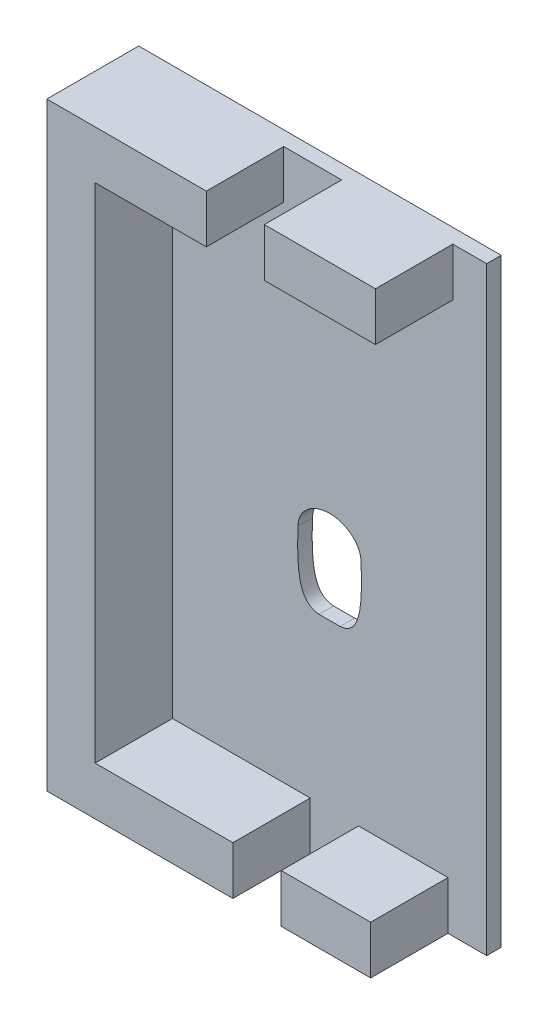
ISO-10303-21;
HEADER;
FILE_DESCRIPTION(('STEP AP214'),'2;1');
FILE_NAME('part.step','',(''),(''),'','','');
FILE_SCHEMA(('AUTOMOTIVE_DESIGN { 1 0 10303 214 1 1 1 1 }'));
ENDSEC;
DATA;
#1=APPLICATION_CONTEXT('core data for automotive mechanical design processes');
#2=APPLICATION_PROTOCOL_DEFINITION('international standard','automotive_design',2000,#1);
#3=PRODUCT_CONTEXT('',#1,'mechanical');
#4=PRODUCT('Part','Part','',(#3));
#5=PRODUCT_RELATED_PRODUCT_CATEGORY('part','',(#4));
#6=PRODUCT_DEFINITION_FORMATION('','',#4);
#7=PRODUCT_DEFINITION_CONTEXT('part definition',#1,'design');
#8=PRODUCT_DEFINITION('design','',#6,#7);
#9=PRODUCT_DEFINITION_SHAPE('','',#8);
#10=(LENGTH_UNIT() NAMED_UNIT(*) SI_UNIT(.MILLI.,.METRE.));
#11=(NAMED_UNIT(*) PLANE_ANGLE_UNIT() SI_UNIT($,.RADIAN.));
#12=(NAMED_UNIT(*) SI_UNIT($,.STERADIAN.) SOLID_ANGLE_UNIT());
#13=UNCERTAINTY_MEASURE_WITH_UNIT(LENGTH_MEASURE(1.E-05),#10,'distance_accuracy_value','');
#14=(GEOMETRIC_REPRESENTATION_CONTEXT(3) GLOBAL_UNCERTAINTY_ASSIGNED_CONTEXT((#13)) GLOBAL_UNIT_ASSIGNED_CONTEXT((#10,
#11,#12)) REPRESENTATION_CONTEXT('',''));
#15=CARTESIAN_POINT('',(0.,0.,0.));
#16=DIRECTION('',(0.,0.,1.));
#17=DIRECTION('',(1.,0.,0.));
#18=AXIS2_PLACEMENT_3D('',#15,#16,#17);
#19=CARTESIAN_POINT('',(0.,0.,19.));
#20=DIRECTION('',(0.,0.,1.));
#21=DIRECTION('',(1.,0.,0.));
#22=AXIS2_PLACEMENT_3D('',#19,#20,#21);
#23=PLANE('',#22);
#24=DIRECTION('',(-1.,0.,0.));
#25=VECTOR('',#24,1.);
#26=CARTESIAN_POINT('',(48.5,10.,19.));
#27=LINE('',#26,#25);
#28=CARTESIAN_POINT('',(67.,10.,19.));
#29=VERTEX_POINT('',#28);
#30=CARTESIAN_POINT('',(48.5,10.,19.));
#31=VERTEX_POINT('',#30);
#32=EDGE_CURVE('E212',#29,#31,#27,.T.);
#33=ORIENTED_EDGE('',*,*,#32,.T.);
#34=DIRECTION('',(0.,-1.,0.));
#35=VECTOR('',#34,1.);
#36=CARTESIAN_POINT('',(48.5,0.,19.));
#37=LINE('',#36,#35);
#38=CARTESIAN_POINT('',(48.5,0.,19.));
#39=VERTEX_POINT('',#38);
#40=EDGE_CURVE('E201',#31,#39,#37,.T.);
#41=ORIENTED_EDGE('',*,*,#40,.T.);
#42=DIRECTION('',(1.,0.,0.));
#43=VECTOR('',#42,1.);
#44=CARTESIAN_POINT('',(0.,0.,19.));
#45=LINE('',#44,#43);
#46=CARTESIAN_POINT('',(67.,0.,19.));
#47=VERTEX_POINT('',#46);
#48=EDGE_CURVE('E185',#39,#47,#45,.T.);
#49=ORIENTED_EDGE('',*,*,#48,.T.);
#50=DIRECTION('',(0.,1.,0.));
#51=VECTOR('',#50,1.);
#52=CARTESIAN_POINT('',(67.,0.,19.));
#53=LINE('',#52,#51);
#54=EDGE_CURVE('E199',#47,#29,#53,.T.);
#55=ORIENTED_EDGE('',*,*,#54,.T.);
#56=EDGE_LOOP('',(#33,#41,#49,#55));
#57=FACE_BOUND('',#56,.T.);
#58=ADVANCED_FACE('F33',(#57),#23,.T.);
#59=DIRECTION('',(1.,0.,0.));
#60=VECTOR('',#59,1.);
#61=CARTESIAN_POINT('',(0.,124.,19.));
#62=LINE('',#61,#60);
#63=CARTESIAN_POINT('',(45.,124.,19.));
#64=VERTEX_POINT('',#63);
#65=CARTESIAN_POINT('',(68.,124.,19.));
#66=VERTEX_POINT('',#65);
#67=EDGE_CURVE('E518',#64,#66,#62,.T.);
#68=ORIENTED_EDGE('',*,*,#67,.F.);
#69=DIRECTION('',(0.,-1.,0.));
#70=VECTOR('',#69,1.);
#71=CARTESIAN_POINT('',(45.,124.,19.));
#72=LINE('',#71,#70);
#73=CARTESIAN_POINT('',(45.,114.,19.));
#74=VERTEX_POINT('',#73);
#75=EDGE_CURVE('E250',#64,#74,#72,.T.);
#76=ORIENTED_EDGE('',*,*,#75,.T.);
#77=CARTESIAN_POINT('',(68.,114.,19.));
#78=DIRECTION('',(-1.,0.,0.));
#79=VECTOR('',#78,1.);
#80=LINE('',#77,#79);
#81=CARTESIAN_POINT('',(68.,114.,19.));
#82=VERTEX_POINT('',#81);
#83=EDGE_CURVE('E261',#82,#74,#80,.T.);
#84=ORIENTED_EDGE('',*,*,#83,.F.);
#85=DIRECTION('',(0.,1.,0.));
#86=VECTOR('',#85,1.);
#87=CARTESIAN_POINT('',(68.,124.,19.));
#88=LINE('',#87,#86);
#89=EDGE_CURVE('E208',#82,#66,#88,.T.);
#90=ORIENTED_EDGE('',*,*,#89,.T.);
#91=EDGE_LOOP('',(#68,#76,#84,#90));
#92=FACE_BOUND('',#91,.T.);
#93=ADVANCED_FACE('F279',(#92),#23,.T.);
#94=DIRECTION('',(-1.,0.,0.));
#95=VECTOR('',#94,1.);
#96=CARTESIAN_POINT('',(20.,10.,19.));
#97=LINE('',#96,#95);
#98=CARTESIAN_POINT('',(38.5,10.,19.));
#99=VERTEX_POINT('',#98);
#100=CARTESIAN_POINT('',(10.,10.,19.));
#101=VERTEX_POINT('',#100);
#102=EDGE_CURVE('E215',#99,#101,#97,.T.);
#103=ORIENTED_EDGE('',*,*,#102,.T.);
#104=DIRECTION('',(0.,1.,0.));
#105=VECTOR('',#104,1.);
#106=CARTESIAN_POINT('',(10.,124.,19.));
#107=LINE('',#106,#105);
#108=CARTESIAN_POINT('',(10.,114.,19.));
#109=VERTEX_POINT('',#108);
#110=EDGE_CURVE('E253',#101,#109,#107,.T.);
#111=ORIENTED_EDGE('',*,*,#110,.T.);
#112=CARTESIAN_POINT('',(33.,114.,19.));
#113=DIRECTION('',(-1.,0.,0.));
#114=VECTOR('',#113,1.);
#115=LINE('',#112,#114);
#116=CARTESIAN_POINT('',(33.,114.,19.));
#117=VERTEX_POINT('',#116);
#118=EDGE_CURVE('E520',#117,#109,#115,.T.);
#119=ORIENTED_EDGE('',*,*,#118,.F.);
#120=DIRECTION('',(0.,1.,0.));
#121=VECTOR('',#120,1.);
#122=CARTESIAN_POINT('',(33.,124.,19.));
#123=LINE('',#122,#121);
#124=CARTESIAN_POINT('',(33.,124.,19.));
#125=VERTEX_POINT('',#124);
#126=EDGE_CURVE('E203',#117,#125,#123,.T.);
#127=ORIENTED_EDGE('',*,*,#126,.T.);
#128=CARTESIAN_POINT('',(0.,124.,19.));
#129=VERTEX_POINT('',#128);
#130=EDGE_CURVE('E516',#129,#125,#62,.T.);
#131=ORIENTED_EDGE('',*,*,#130,.F.);
#132=DIRECTION('',(0.,1.,0.));
#133=VECTOR('',#132,1.);
#134=CARTESIAN_POINT('',(0.,0.,19.));
#135=LINE('',#134,#133);
#136=CARTESIAN_POINT('',(0.,0.,19.));
#137=VERTEX_POINT('',#136);
#138=EDGE_CURVE('E256',#137,#129,#135,.T.);
#139=ORIENTED_EDGE('',*,*,#138,.F.);
#140=CARTESIAN_POINT('',(38.5,0.,19.));
#141=VERTEX_POINT('',#140);
#142=EDGE_CURVE('E202',#137,#141,#45,.T.);
#143=ORIENTED_EDGE('',*,*,#142,.T.);
#144=DIRECTION('',(0.,1.,0.));
#145=VECTOR('',#144,1.);
#146=CARTESIAN_POINT('',(38.5,0.,19.));
#147=LINE('',#146,#145);
#148=EDGE_CURVE('E214',#141,#99,#147,.T.);
#149=ORIENTED_EDGE('',*,*,#148,.T.);
#150=EDGE_LOOP('',(#103,#111,#119,#127,#131,#139,#143,#149));
#151=FACE_BOUND('',#150,.T.);
#152=ADVANCED_FACE('F280',(#151),#23,.T.);
#153=CARTESIAN_POINT('',(40.3205360374278,43.8282784351919,45.001));
#154=CARTESIAN_POINT('',(36.940368492597,44.1088043462592,45.001));
#155=CARTESIAN_POINT('',(35.4948835545112,47.2516643831489,45.001));
#156=CARTESIAN_POINT('',(35.9840812231567,57.5,45.001));
#157=B_SPLINE_CURVE_WITH_KNOTS('',3,(#153,#154,#155,#156),.UNSPECIFIED.,.F.,.F.,(4,4),
(0.162125932616789,1.),.UNSPECIFIED.);
#158=DIRECTION('',(0.,0.,-1.));
#159=VECTOR('',#158,1.);
#160=SURFACE_OF_LINEAR_EXTRUSION('',#157,#159);
#161=CARTESIAN_POINT('',(40.3205360374278,43.8282784351919,3.));
#162=CARTESIAN_POINT('',(36.940368492597,44.1088043462592,3.));
#163=CARTESIAN_POINT('',(35.4948835545112,47.2516643831489,3.));
#164=CARTESIAN_POINT('',(35.9840812231567,57.5,3.));
#165=B_SPLINE_CURVE_WITH_KNOTS('',3,(#161,#162,#163,#164),.UNSPECIFIED.,.F.,.F.,(4,4),
(0.162125932616789,1.),.UNSPECIFIED.);
#166=CARTESIAN_POINT('',(35.9840812231567,57.5,3.));
#167=VERTEX_POINT('',#166);
#168=CARTESIAN_POINT('',(40.3205360374278,43.8282784351919,3.));
#169=VERTEX_POINT('',#168);
#170=EDGE_CURVE('E232',#167,#169,#165,.F.);
#171=ORIENTED_EDGE('',*,*,#170,.T.);
#172=DIRECTION('',(0.,0.,-1.));
#173=VECTOR('',#172,1.);
#174=CARTESIAN_POINT('',(40.3205360374278,43.8282784351919,45.001));
#175=LINE('',#174,#173);
#176=CARTESIAN_POINT('',(40.3205360374278,43.8282784351919,0.));
#177=VERTEX_POINT('',#176);
#178=EDGE_CURVE('E341',#169,#177,#175,.T.);
#179=ORIENTED_EDGE('',*,*,#178,.T.);
#180=CARTESIAN_POINT('',(40.3205360374278,43.8282784351919,0.));
#181=CARTESIAN_POINT('',(36.940368492597,44.1088043462592,0.));
#182=CARTESIAN_POINT('',(35.4948835545112,47.2516643831489,0.));
#183=CARTESIAN_POINT('',(35.9840812231567,57.5,0.));
#184=B_SPLINE_CURVE_WITH_KNOTS('',3,(#180,#181,#182,#183),.UNSPECIFIED.,.F.,.F.,(4,4),
(0.162125932616789,1.),.UNSPECIFIED.);
#185=CARTESIAN_POINT('',(35.9840812231567,57.5,0.));
#186=VERTEX_POINT('',#185);
#187=EDGE_CURVE('E539',#177,#186,#184,.T.);
#188=ORIENTED_EDGE('',*,*,#187,.T.);
#189=DIRECTION('',(0.,0.,-1.));
#190=VECTOR('',#189,1.);
#191=CARTESIAN_POINT('',(35.9840812231567,57.5,45.001));
#192=LINE('',#191,#190);
#193=EDGE_CURVE('E346',#167,#186,#192,.T.);
#194=ORIENTED_EDGE('',*,*,#193,.F.);
#195=EDGE_LOOP('',(#171,#179,#188,#194));
#196=FACE_BOUND('',#195,.T.);
#197=ADVANCED_FACE('F318',(#196),#160,.F.);
#198=CARTESIAN_POINT('',(44.6794639625724,43.8282784351919,45.001));
#199=DIRECTION('',(0.,-1.,0.));
#200=DIRECTION('',(0.,0.,-1.));
#201=AXIS2_PLACEMENT_3D('',#198,#199,#200);
#202=PLANE('',#201);
#203=DIRECTION('',(1.,0.,0.));
#204=VECTOR('',#203,1.);
#205=CARTESIAN_POINT('',(44.6794639625724,43.8282784351919,3.));
#206=LINE('',#205,#204);
#207=CARTESIAN_POINT('',(44.6794639625724,43.8282784351919,3.));
#208=VERTEX_POINT('',#207);
#209=EDGE_CURVE('E361',#169,#208,#206,.T.);
#210=ORIENTED_EDGE('',*,*,#209,.T.);
#211=DIRECTION('',(0.,0.,-1.));
#212=VECTOR('',#211,1.);
#213=CARTESIAN_POINT('',(44.6794639625724,43.8282784351919,45.001));
#214=LINE('',#213,#212);
#215=CARTESIAN_POINT('',(44.6794639625724,43.8282784351919,0.));
#216=VERTEX_POINT('',#215);
#217=EDGE_CURVE('E11',#208,#216,#214,.T.);
#218=ORIENTED_EDGE('',*,*,#217,.T.);
#219=DIRECTION('',(-1.,0.,0.));
#220=VECTOR('',#219,1.);
#221=CARTESIAN_POINT('',(44.6794639625724,43.8282784351919,0.));
#222=LINE('',#221,#220);
#223=EDGE_CURVE('E543',#216,#177,#222,.T.);
#224=ORIENTED_EDGE('',*,*,#223,.T.);
#225=ORIENTED_EDGE('',*,*,#178,.F.);
#226=EDGE_LOOP('',(#210,#218,#224,#225));
#227=FACE_BOUND('',#226,.T.);
#228=ADVANCED_FACE('F320',(#227),#202,.F.);
#229=CARTESIAN_POINT('',(49.0159187768433,57.5,45.001));
#230=CARTESIAN_POINT('',(49.5051164454888,47.2516643831521,45.001));
#231=CARTESIAN_POINT('',(48.0596315074031,44.1088043462593,45.001));
#232=CARTESIAN_POINT('',(44.6794639625725,43.8282784351919,45.001));
#233=B_SPLINE_CURVE_WITH_KNOTS('',3,(#229,#230,#231,#232),.UNSPECIFIED.,.F.,.F.,(4,4),
(0.162125932616804,1.),.UNSPECIFIED.);
#234=DIRECTION('',(0.,0.,-1.));
#235=VECTOR('',#234,1.);
#236=SURFACE_OF_LINEAR_EXTRUSION('',#233,#235);
#237=CARTESIAN_POINT('',(49.0159187768433,57.5,3.));
#238=CARTESIAN_POINT('',(49.5051164454888,47.2516643831521,3.));
#239=CARTESIAN_POINT('',(48.0596315074031,44.1088043462593,3.));
#240=CARTESIAN_POINT('',(44.6794639625725,43.8282784351919,3.));
#241=B_SPLINE_CURVE_WITH_KNOTS('',3,(#237,#238,#239,#240),.UNSPECIFIED.,.F.,.F.,(4,4),
(0.162125932616804,1.),.UNSPECIFIED.);
#242=CARTESIAN_POINT('',(49.0159187768433,57.5,3.));
#243=VERTEX_POINT('',#242);
#244=EDGE_CURVE('E357',#208,#243,#241,.F.);
#245=ORIENTED_EDGE('',*,*,#244,.T.);
#246=DIRECTION('',(0.,0.,-1.));
#247=VECTOR('',#246,1.);
#248=CARTESIAN_POINT('',(49.0159187768433,57.5,45.001));
#249=LINE('',#248,#247);
#250=CARTESIAN_POINT('',(49.0159187768433,57.5,0.));
#251=VERTEX_POINT('',#250);
#252=EDGE_CURVE('E42',#243,#251,#249,.T.);
#253=ORIENTED_EDGE('',*,*,#252,.T.);
#254=CARTESIAN_POINT('',(49.0159187768433,57.5,0.));
#255=CARTESIAN_POINT('',(49.5051164454888,47.2516643831521,0.));
#256=CARTESIAN_POINT('',(48.0596315074031,44.1088043462593,0.));
#257=CARTESIAN_POINT('',(44.6794639625725,43.8282784351919,0.));
#258=B_SPLINE_CURVE_WITH_KNOTS('',3,(#254,#255,#256,#257),.UNSPECIFIED.,.F.,.F.,(4,4),
(0.162125932616804,1.),.UNSPECIFIED.);
#259=EDGE_CURVE('E347',#251,#216,#258,.T.);
#260=ORIENTED_EDGE('',*,*,#259,.T.);
#261=ORIENTED_EDGE('',*,*,#217,.F.);
#262=EDGE_LOOP('',(#245,#253,#260,#261));
#263=FACE_BOUND('',#262,.T.);
#264=ADVANCED_FACE('F327',(#263),#236,.F.);
#265=CARTESIAN_POINT('',(42.5,57.5,45.001));
#266=DIRECTION('',(0.,0.,-1.));
#267=DIRECTION('',(-1.,0.,0.));
#268=AXIS2_PLACEMENT_3D('',#265,#266,#267);
#269=ELLIPSE('',#268,6.51591877684335,5.50395470143701);
#270=DIRECTION('',(0.,0.,-1.));
#271=VECTOR('',#270,1.);
#272=SURFACE_OF_LINEAR_EXTRUSION('',#269,#271);
#273=CARTESIAN_POINT('',(42.5,57.5,3.));
#274=DIRECTION('',(0.,0.,-1.));
#275=DIRECTION('',(-1.,0.,0.));
#276=AXIS2_PLACEMENT_3D('',#273,#274,#275);
#277=ELLIPSE('',#276,6.51591877684335,5.50395470143701);
#278=EDGE_CURVE('E352',#243,#167,#277,.F.);
#279=ORIENTED_EDGE('',*,*,#278,.T.);
#280=ORIENTED_EDGE('',*,*,#193,.T.);
#281=CARTESIAN_POINT('',(42.5,57.5,0.));
#282=DIRECTION('',(0.,0.,-1.));
#283=DIRECTION('',(-1.,0.,0.));
#284=AXIS2_PLACEMENT_3D('',#281,#282,#283);
#285=ELLIPSE('',#284,6.51591877684335,5.50395470143701);
#286=EDGE_CURVE('E535',#186,#251,#285,.T.);
#287=ORIENTED_EDGE('',*,*,#286,.T.);
#288=ORIENTED_EDGE('',*,*,#252,.F.);
#289=EDGE_LOOP('',(#279,#280,#287,#288));
#290=FACE_BOUND('',#289,.T.);
#291=ADVANCED_FACE('F287',(#290),#272,.F.);
#292=CARTESIAN_POINT('',(38.5,0.,45.));
#293=DIRECTION('',(-1.,0.,0.));
#294=DIRECTION('',(0.,0.,1.));
#295=AXIS2_PLACEMENT_3D('',#292,#293,#294);
#296=PLANE('',#295);
#297=ORIENTED_EDGE('',*,*,#148,.F.);
#298=DIRECTION('',(0.,0.,-1.));
#299=VECTOR('',#298,1.);
#300=CARTESIAN_POINT('',(38.5,0.,45.));
#301=LINE('',#300,#299);
#302=CARTESIAN_POINT('',(38.5,0.,3.));
#303=VERTEX_POINT('',#302);
#304=EDGE_CURVE('E500',#141,#303,#301,.T.);
#305=ORIENTED_EDGE('',*,*,#304,.T.);
#306=DIRECTION('',(0.,1.,0.));
#307=VECTOR('',#306,1.);
#308=CARTESIAN_POINT('',(38.5,0.,3.));
#309=LINE('',#308,#307);
#310=CARTESIAN_POINT('',(38.5,10.,3.));
#311=VERTEX_POINT('',#310);
#312=EDGE_CURVE('E396',#303,#311,#309,.T.);
#313=ORIENTED_EDGE('',*,*,#312,.T.);
#314=DIRECTION('',(0.,0.,-1.));
#315=VECTOR('',#314,1.);
#316=CARTESIAN_POINT('',(38.5,10.,45.));
#317=LINE('',#316,#315);
#318=EDGE_CURVE('E225',#99,#311,#317,.T.);
#319=ORIENTED_EDGE('',*,*,#318,.F.);
#320=EDGE_LOOP('',(#297,#305,#313,#319));
#321=FACE_BOUND('',#320,.T.);
#322=ADVANCED_FACE('F282',(#321),#296,.F.);
#323=CARTESIAN_POINT('',(0.,0.,0.));
#324=DIRECTION('',(0.,0.,-1.));
#325=DIRECTION('',(-1.,0.,0.));
#326=AXIS2_PLACEMENT_3D('',#323,#324,#325);
#327=PLANE('',#326);
#328=ORIENTED_EDGE('',*,*,#259,.F.);
#329=ORIENTED_EDGE('',*,*,#286,.F.);
#330=ORIENTED_EDGE('',*,*,#187,.F.);
#331=ORIENTED_EDGE('',*,*,#223,.F.);
#332=EDGE_LOOP('',(#328,#329,#330,#331));
#333=FACE_BOUND('',#332,.T.);
#334=DIRECTION('',(0.,1.,0.));
#335=VECTOR('',#334,1.);
#336=CARTESIAN_POINT('',(0.,0.,0.));
#337=LINE('',#336,#335);
#338=CARTESIAN_POINT('',(0.,0.,0.));
#339=VERTEX_POINT('',#338);
#340=CARTESIAN_POINT('',(0.,124.,0.));
#341=VERTEX_POINT('',#340);
#342=EDGE_CURVE('E420',#339,#341,#337,.T.);
#343=ORIENTED_EDGE('',*,*,#342,.T.);
#344=DIRECTION('',(1.,0.,0.));
#345=VECTOR('',#344,1.);
#346=CARTESIAN_POINT('',(0.,124.,0.));
#347=LINE('',#346,#345);
#348=CARTESIAN_POINT('',(75.,124.,0.));
#349=VERTEX_POINT('',#348);
#350=EDGE_CURVE('E470',#341,#349,#347,.T.);
#351=ORIENTED_EDGE('',*,*,#350,.T.);
#352=DIRECTION('',(0.,1.,0.));
#353=VECTOR('',#352,1.);
#354=CARTESIAN_POINT('',(75.,0.,0.));
#355=LINE('',#354,#353);
#356=CARTESIAN_POINT('',(75.,0.,0.));
#357=VERTEX_POINT('',#356);
#358=EDGE_CURVE('E464',#357,#349,#355,.T.);
#359=ORIENTED_EDGE('',*,*,#358,.F.);
#360=DIRECTION('',(1.,0.,0.));
#361=VECTOR('',#360,1.);
#362=CARTESIAN_POINT('',(0.,0.,0.));
#363=LINE('',#362,#361);
#364=EDGE_CURVE('E426',#339,#357,#363,.T.);
#365=ORIENTED_EDGE('',*,*,#364,.F.);
#366=EDGE_LOOP('',(#343,#351,#359,#365));
#367=FACE_BOUND('',#366,.T.);
#368=ADVANCED_FACE('F286',(#333,#367),#327,.T.);
#369=CARTESIAN_POINT('',(75.,0.,3.));
#370=DIRECTION('',(-1.,0.,0.));
#371=DIRECTION('',(0.,-1.,0.));
#372=AXIS2_PLACEMENT_3D('',#369,#370,#371);
#373=PLANE('',#372);
#374=ORIENTED_EDGE('',*,*,#358,.T.);
#375=DIRECTION('',(0.,0.,-1.));
#376=VECTOR('',#375,1.);
#377=CARTESIAN_POINT('',(75.,124.,3.));
#378=LINE('',#377,#376);
#379=CARTESIAN_POINT('',(75.,124.,3.));
#380=VERTEX_POINT('',#379);
#381=EDGE_CURVE('E416',#380,#349,#378,.T.);
#382=ORIENTED_EDGE('',*,*,#381,.F.);
#383=DIRECTION('',(0.,1.,0.));
#384=VECTOR('',#383,1.);
#385=CARTESIAN_POINT('',(75.,0.,3.));
#386=LINE('',#385,#384);
#387=CARTESIAN_POINT('',(75.,0.,3.));
#388=VERTEX_POINT('',#387);
#389=EDGE_CURVE('E415',#388,#380,#386,.T.);
#390=ORIENTED_EDGE('',*,*,#389,.F.);
#391=DIRECTION('',(0.,0.,-1.));
#392=VECTOR('',#391,1.);
#393=CARTESIAN_POINT('',(75.,0.,3.));
#394=LINE('',#393,#392);
#395=EDGE_CURVE('E467',#388,#357,#394,.T.);
#396=ORIENTED_EDGE('',*,*,#395,.T.);
#397=EDGE_LOOP('',(#374,#382,#390,#396));
#398=FACE_BOUND('',#397,.T.);
#399=ADVANCED_FACE('F293',(#398),#373,.F.);
#400=CARTESIAN_POINT('',(0.,0.,3.));
#401=DIRECTION('',(-1.,0.,0.));
#402=DIRECTION('',(0.,-1.,0.));
#403=AXIS2_PLACEMENT_3D('',#400,#401,#402);
#404=PLANE('',#403);
#405=DIRECTION('',(0.,0.,-1.));
#406=VECTOR('',#405,1.);
#407=CARTESIAN_POINT('',(0.,0.,3.));
#408=LINE('',#407,#406);
#409=EDGE_CURVE('E479',#137,#339,#408,.T.);
#410=ORIENTED_EDGE('',*,*,#409,.F.);
#411=ORIENTED_EDGE('',*,*,#138,.T.);
#412=DIRECTION('',(0.,0.,-1.));
#413=VECTOR('',#412,1.);
#414=CARTESIAN_POINT('',(0.,124.,3.));
#415=LINE('',#414,#413);
#416=EDGE_CURVE('E413',#129,#341,#415,.T.);
#417=ORIENTED_EDGE('',*,*,#416,.T.);
#418=ORIENTED_EDGE('',*,*,#342,.F.);
#419=EDGE_LOOP('',(#410,#411,#417,#418));
#420=FACE_BOUND('',#419,.T.);
#421=ADVANCED_FACE('F289',(#420),#404,.T.);
#422=CARTESIAN_POINT('',(0.,124.,3.));
#423=DIRECTION('',(0.,1.,0.));
#424=DIRECTION('',(0.,0.,1.));
#425=AXIS2_PLACEMENT_3D('',#422,#423,#424);
#426=PLANE('',#425);
#427=ORIENTED_EDGE('',*,*,#416,.F.);
#428=ORIENTED_EDGE('',*,*,#130,.T.);
#429=DIRECTION('',(0.,0.,-1.));
#430=VECTOR('',#429,1.);
#431=CARTESIAN_POINT('',(33.,124.,32.));
#432=LINE('',#431,#430);
#433=CARTESIAN_POINT('',(33.,124.,3.));
#434=VERTEX_POINT('',#433);
#435=EDGE_CURVE('E506',#125,#434,#432,.T.);
#436=ORIENTED_EDGE('',*,*,#435,.T.);
#437=DIRECTION('',(1.,0.,0.));
#438=VECTOR('',#437,1.);
#439=CARTESIAN_POINT('',(0.,124.,3.));
#440=LINE('',#439,#438);
#441=CARTESIAN_POINT('',(45.,124.,3.));
#442=VERTEX_POINT('',#441);
#443=EDGE_CURVE('E423',#434,#442,#440,.T.);
#444=ORIENTED_EDGE('',*,*,#443,.T.);
#445=DIRECTION('',(0.,0.,-1.));
#446=VECTOR('',#445,1.);
#447=CARTESIAN_POINT('',(45.,124.,32.));
#448=LINE('',#447,#446);
#449=EDGE_CURVE('E266',#64,#442,#448,.T.);
#450=ORIENTED_EDGE('',*,*,#449,.F.);
#451=ORIENTED_EDGE('',*,*,#67,.T.);
#452=DIRECTION('',(0.,0.,-1.));
#453=VECTOR('',#452,1.);
#454=CARTESIAN_POINT('',(68.,124.,32.));
#455=LINE('',#454,#453);
#456=CARTESIAN_POINT('',(68.,124.,3.));
#457=VERTEX_POINT('',#456);
#458=EDGE_CURVE('E532',#66,#457,#455,.T.);
#459=ORIENTED_EDGE('',*,*,#458,.T.);
#460=EDGE_CURVE('E424',#457,#380,#440,.T.);
#461=ORIENTED_EDGE('',*,*,#460,.T.);
#462=ORIENTED_EDGE('',*,*,#381,.T.);
#463=ORIENTED_EDGE('',*,*,#350,.F.);
#464=EDGE_LOOP('',(#427,#428,#436,#444,#450,#451,#459,#461,#462,#463));
#465=FACE_BOUND('',#464,.T.);
#466=ADVANCED_FACE('F292',(#465),#426,.T.);
#467=CARTESIAN_POINT('',(48.5,10.,45.));
#468=DIRECTION('',(0.,-1.,0.));
#469=DIRECTION('',(0.,0.,-1.));
#470=AXIS2_PLACEMENT_3D('',#467,#468,#469);
#471=PLANE('',#470);
#472=ORIENTED_EDGE('',*,*,#32,.F.);
#473=DIRECTION('',(0.,0.,-1.));
#474=VECTOR('',#473,1.);
#475=CARTESIAN_POINT('',(67.,10.,45.));
#476=LINE('',#475,#474);
#477=CARTESIAN_POINT('',(67.,10.,3.));
#478=VERTEX_POINT('',#477);
#479=EDGE_CURVE('E193',#29,#478,#476,.T.);
#480=ORIENTED_EDGE('',*,*,#479,.T.);
#481=DIRECTION('',(-1.,0.,0.));
#482=VECTOR('',#481,1.);
#483=CARTESIAN_POINT('',(48.5,10.,3.));
#484=LINE('',#483,#482);
#485=CARTESIAN_POINT('',(48.5,10.,3.));
#486=VERTEX_POINT('',#485);
#487=EDGE_CURVE('E224',#478,#486,#484,.T.);
#488=ORIENTED_EDGE('',*,*,#487,.T.);
#489=DIRECTION('',(0.,0.,-1.));
#490=VECTOR('',#489,1.);
#491=CARTESIAN_POINT('',(48.5,10.,45.));
#492=LINE('',#491,#490);
#493=EDGE_CURVE('E221',#31,#486,#492,.T.);
#494=ORIENTED_EDGE('',*,*,#493,.F.);
#495=EDGE_LOOP('',(#472,#480,#488,#494));
#496=FACE_BOUND('',#495,.T.);
#497=ADVANCED_FACE('F297',(#496),#471,.F.);
#498=CARTESIAN_POINT('',(0.,0.,3.));
#499=DIRECTION('',(0.,0.,-1.));
#500=DIRECTION('',(-1.,0.,0.));
#501=AXIS2_PLACEMENT_3D('',#498,#499,#500);
#502=PLANE('',#501);
#503=ORIENTED_EDGE('',*,*,#278,.F.);
#504=ORIENTED_EDGE('',*,*,#244,.F.);
#505=ORIENTED_EDGE('',*,*,#209,.F.);
#506=ORIENTED_EDGE('',*,*,#170,.F.);
#507=EDGE_LOOP('',(#503,#504,#505,#506));
#508=FACE_BOUND('',#507,.T.);
#509=DIRECTION('',(0.,1.,0.));
#510=VECTOR('',#509,1.);
#511=CARTESIAN_POINT('',(10.,124.,3.));
#512=LINE('',#511,#510);
#513=CARTESIAN_POINT('',(10.,9.99999999999999,3.));
#514=VERTEX_POINT('',#513);
#515=CARTESIAN_POINT('',(10.,114.,3.));
#516=VERTEX_POINT('',#515);
#517=EDGE_CURVE('E498',#514,#516,#512,.T.);
#518=ORIENTED_EDGE('',*,*,#517,.F.);
#519=DIRECTION('',(-1.,0.,0.));
#520=VECTOR('',#519,1.);
#521=CARTESIAN_POINT('',(20.,10.,3.));
#522=LINE('',#521,#520);
#523=EDGE_CURVE('E398',#311,#514,#522,.T.);
#524=ORIENTED_EDGE('',*,*,#523,.F.);
#525=ORIENTED_EDGE('',*,*,#312,.F.);
#526=DIRECTION('',(1.,0.,0.));
#527=VECTOR('',#526,1.);
#528=CARTESIAN_POINT('',(0.,0.,3.));
#529=LINE('',#528,#527);
#530=CARTESIAN_POINT('',(48.5,0.,3.));
#531=VERTEX_POINT('',#530);
#532=EDGE_CURVE('E411',#303,#531,#529,.T.);
#533=ORIENTED_EDGE('',*,*,#532,.T.);
#534=DIRECTION('',(0.,-1.,0.));
#535=VECTOR('',#534,1.);
#536=CARTESIAN_POINT('',(48.5,0.,3.));
#537=LINE('',#536,#535);
#538=EDGE_CURVE('E233',#486,#531,#537,.T.);
#539=ORIENTED_EDGE('',*,*,#538,.F.);
#540=ORIENTED_EDGE('',*,*,#487,.F.);
#541=DIRECTION('',(0.,1.,0.));
#542=VECTOR('',#541,1.);
#543=CARTESIAN_POINT('',(67.,0.,3.));
#544=LINE('',#543,#542);
#545=CARTESIAN_POINT('',(67.,0.,3.));
#546=VERTEX_POINT('',#545);
#547=EDGE_CURVE('E406',#546,#478,#544,.T.);
#548=ORIENTED_EDGE('',*,*,#547,.F.);
#549=EDGE_CURVE('E188',#546,#388,#529,.T.);
#550=ORIENTED_EDGE('',*,*,#549,.T.);
#551=ORIENTED_EDGE('',*,*,#389,.T.);
#552=ORIENTED_EDGE('',*,*,#460,.F.);
#553=DIRECTION('',(0.,1.,0.));
#554=VECTOR('',#553,1.);
#555=CARTESIAN_POINT('',(68.,124.,3.));
#556=LINE('',#555,#554);
#557=CARTESIAN_POINT('',(68.,114.,3.));
#558=VERTEX_POINT('',#557);
#559=EDGE_CURVE('E490',#558,#457,#556,.T.);
#560=ORIENTED_EDGE('',*,*,#559,.F.);
#561=DIRECTION('',(1.,0.,0.));
#562=VECTOR('',#561,1.);
#563=CARTESIAN_POINT('',(45.,114.,3.));
#564=LINE('',#563,#562);
#565=CARTESIAN_POINT('',(45.,114.,3.));
#566=VERTEX_POINT('',#565);
#567=EDGE_CURVE('E493',#566,#558,#564,.T.);
#568=ORIENTED_EDGE('',*,*,#567,.F.);
#569=DIRECTION('',(0.,-1.,0.));
#570=VECTOR('',#569,1.);
#571=CARTESIAN_POINT('',(45.,124.,3.));
#572=LINE('',#571,#570);
#573=EDGE_CURVE('E496',#442,#566,#572,.T.);
#574=ORIENTED_EDGE('',*,*,#573,.F.);
#575=ORIENTED_EDGE('',*,*,#443,.F.);
#576=DIRECTION('',(0.,1.,0.));
#577=VECTOR('',#576,1.);
#578=CARTESIAN_POINT('',(33.,124.,3.));
#579=LINE('',#578,#577);
#580=CARTESIAN_POINT('',(33.,114.,3.));
#581=VERTEX_POINT('',#580);
#582=EDGE_CURVE('E507',#581,#434,#579,.T.);
#583=ORIENTED_EDGE('',*,*,#582,.F.);
#584=DIRECTION('',(1.,0.,0.));
#585=VECTOR('',#584,1.);
#586=CARTESIAN_POINT('',(10.,114.,3.));
#587=LINE('',#586,#585);
#588=EDGE_CURVE('E484',#516,#581,#587,.T.);
#589=ORIENTED_EDGE('',*,*,#588,.F.);
#590=EDGE_LOOP('',(#518,#524,#525,#533,#539,#540,#548,#550,#551,#552,#560,#568,#574,#575,#583,#589));
#591=FACE_BOUND('',#590,.T.);
#592=ADVANCED_FACE('F303',(#508,#591),#502,.F.);
#593=CARTESIAN_POINT('',(10.,124.,45.));
#594=DIRECTION('',(-1.,0.,0.));
#595=DIRECTION('',(0.,-1.,0.));
#596=AXIS2_PLACEMENT_3D('',#593,#594,#595);
#597=PLANE('',#596);
#598=ORIENTED_EDGE('',*,*,#110,.F.);
#599=DIRECTION('',(0.,0.,1.));
#600=VECTOR('',#599,1.);
#601=CARTESIAN_POINT('',(10.,10.,-0.002000000000002));
#602=LINE('',#601,#600);
#603=EDGE_CURVE('E229',#514,#101,#602,.T.);
#604=ORIENTED_EDGE('',*,*,#603,.F.);
#605=ORIENTED_EDGE('',*,*,#517,.T.);
#606=DIRECTION('',(0.,0.,-1.));
#607=VECTOR('',#606,1.);
#608=CARTESIAN_POINT('',(10.,114.,32.));
#609=LINE('',#608,#607);
#610=EDGE_CURVE('E432',#109,#516,#609,.T.);
#611=ORIENTED_EDGE('',*,*,#610,.F.);
#612=EDGE_LOOP('',(#598,#604,#605,#611));
#613=FACE_BOUND('',#612,.T.);
#614=ADVANCED_FACE('F299',(#613),#597,.F.);
#615=CARTESIAN_POINT('',(33.,124.,32.));
#616=DIRECTION('',(-1.,0.,0.));
#617=DIRECTION('',(0.,-1.,0.));
#618=AXIS2_PLACEMENT_3D('',#615,#616,#617);
#619=PLANE('',#618);
#620=ORIENTED_EDGE('',*,*,#126,.F.);
#621=DIRECTION('',(0.,0.,-1.));
#622=VECTOR('',#621,1.);
#623=CARTESIAN_POINT('',(33.,114.,32.));
#624=LINE('',#623,#622);
#625=EDGE_CURVE('E435',#117,#581,#624,.T.);
#626=ORIENTED_EDGE('',*,*,#625,.T.);
#627=ORIENTED_EDGE('',*,*,#582,.T.);
#628=ORIENTED_EDGE('',*,*,#435,.F.);
#629=EDGE_LOOP('',(#620,#626,#627,#628));
#630=FACE_BOUND('',#629,.T.);
#631=ADVANCED_FACE('F302',(#630),#619,.F.);
#632=CARTESIAN_POINT('',(10.,114.,32.));
#633=DIRECTION('',(0.,1.,0.));
#634=DIRECTION('',(0.,0.,1.));
#635=AXIS2_PLACEMENT_3D('',#632,#633,#634);
#636=PLANE('',#635);
#637=ORIENTED_EDGE('',*,*,#625,.F.);
#638=ORIENTED_EDGE('',*,*,#118,.T.);
#639=ORIENTED_EDGE('',*,*,#610,.T.);
#640=ORIENTED_EDGE('',*,*,#588,.T.);
#641=EDGE_LOOP('',(#637,#638,#639,#640));
#642=FACE_BOUND('',#641,.T.);
#643=ADVANCED_FACE('F306',(#642),#636,.F.);
#644=CARTESIAN_POINT('',(45.,124.,32.));
#645=DIRECTION('',(1.,0.,0.));
#646=DIRECTION('',(0.,0.,-1.));
#647=AXIS2_PLACEMENT_3D('',#644,#645,#646);
#648=PLANE('',#647);
#649=ORIENTED_EDGE('',*,*,#75,.F.);
#650=ORIENTED_EDGE('',*,*,#449,.T.);
#651=ORIENTED_EDGE('',*,*,#573,.T.);
#652=DIRECTION('',(0.,0.,-1.));
#653=VECTOR('',#652,1.);
#654=CARTESIAN_POINT('',(45.,114.,32.));
#655=LINE('',#654,#653);
#656=EDGE_CURVE('E481',#74,#566,#655,.T.);
#657=ORIENTED_EDGE('',*,*,#656,.F.);
#658=EDGE_LOOP('',(#649,#650,#651,#657));
#659=FACE_BOUND('',#658,.T.);
#660=ADVANCED_FACE('F377',(#659),#648,.F.);
#661=CARTESIAN_POINT('',(68.,124.,32.));
#662=DIRECTION('',(-1.,0.,0.));
#663=DIRECTION('',(0.,0.,1.));
#664=AXIS2_PLACEMENT_3D('',#661,#662,#663);
#665=PLANE('',#664);
#666=ORIENTED_EDGE('',*,*,#89,.F.);
#667=DIRECTION('',(0.,0.,-1.));
#668=VECTOR('',#667,1.);
#669=CARTESIAN_POINT('',(68.,114.,32.));
#670=LINE('',#669,#668);
#671=EDGE_CURVE('E483',#82,#558,#670,.T.);
#672=ORIENTED_EDGE('',*,*,#671,.T.);
#673=ORIENTED_EDGE('',*,*,#559,.T.);
#674=ORIENTED_EDGE('',*,*,#458,.F.);
#675=EDGE_LOOP('',(#666,#672,#673,#674));
#676=FACE_BOUND('',#675,.T.);
#677=ADVANCED_FACE('F315',(#676),#665,.F.);
#678=CARTESIAN_POINT('',(45.,114.,32.));
#679=DIRECTION('',(0.,1.,0.));
#680=DIRECTION('',(0.,0.,1.));
#681=AXIS2_PLACEMENT_3D('',#678,#679,#680);
#682=PLANE('',#681);
#683=ORIENTED_EDGE('',*,*,#671,.F.);
#684=ORIENTED_EDGE('',*,*,#83,.T.);
#685=ORIENTED_EDGE('',*,*,#656,.T.);
#686=ORIENTED_EDGE('',*,*,#567,.T.);
#687=EDGE_LOOP('',(#683,#684,#685,#686));
#688=FACE_BOUND('',#687,.T.);
#689=ADVANCED_FACE('F309',(#688),#682,.F.);
#690=CARTESIAN_POINT('',(0.,0.,3.));
#691=DIRECTION('',(0.,1.,0.));
#692=DIRECTION('',(0.,0.,1.));
#693=AXIS2_PLACEMENT_3D('',#690,#691,#692);
#694=PLANE('',#693);
#695=ORIENTED_EDGE('',*,*,#142,.F.);
#696=ORIENTED_EDGE('',*,*,#409,.T.);
#697=ORIENTED_EDGE('',*,*,#364,.T.);
#698=ORIENTED_EDGE('',*,*,#395,.F.);
#699=ORIENTED_EDGE('',*,*,#549,.F.);
#700=DIRECTION('',(0.,0.,-1.));
#701=VECTOR('',#700,1.);
#702=CARTESIAN_POINT('',(67.,0.,45.));
#703=LINE('',#702,#701);
#704=EDGE_CURVE('E181',#47,#546,#703,.T.);
#705=ORIENTED_EDGE('',*,*,#704,.F.);
#706=ORIENTED_EDGE('',*,*,#48,.F.);
#707=DIRECTION('',(0.,0.,-1.));
#708=VECTOR('',#707,1.);
#709=CARTESIAN_POINT('',(48.5,0.,45.));
#710=LINE('',#709,#708);
#711=EDGE_CURVE('E194',#39,#531,#710,.T.);
#712=ORIENTED_EDGE('',*,*,#711,.T.);
#713=ORIENTED_EDGE('',*,*,#532,.F.);
#714=ORIENTED_EDGE('',*,*,#304,.F.);
#715=EDGE_LOOP('',(#695,#696,#697,#698,#699,#705,#706,#712,#713,#714));
#716=FACE_BOUND('',#715,.T.);
#717=ADVANCED_FACE('F184',(#716),#694,.F.);
#718=CARTESIAN_POINT('',(67.,0.,45.));
#719=DIRECTION('',(-1.,0.,0.));
#720=DIRECTION('',(0.,0.,1.));
#721=AXIS2_PLACEMENT_3D('',#718,#719,#720);
#722=PLANE('',#721);
#723=ORIENTED_EDGE('',*,*,#54,.F.);
#724=ORIENTED_EDGE('',*,*,#704,.T.);
#725=ORIENTED_EDGE('',*,*,#547,.T.);
#726=ORIENTED_EDGE('',*,*,#479,.F.);
#727=EDGE_LOOP('',(#723,#724,#725,#726));
#728=FACE_BOUND('',#727,.T.);
#729=ADVANCED_FACE('F205',(#728),#722,.F.);
#730=CARTESIAN_POINT('',(48.5,0.,45.));
#731=DIRECTION('',(1.,0.,0.));
#732=DIRECTION('',(0.,0.,-1.));
#733=AXIS2_PLACEMENT_3D('',#730,#731,#732);
#734=PLANE('',#733);
#735=ORIENTED_EDGE('',*,*,#40,.F.);
#736=ORIENTED_EDGE('',*,*,#493,.T.);
#737=ORIENTED_EDGE('',*,*,#538,.T.);
#738=ORIENTED_EDGE('',*,*,#711,.F.);
#739=EDGE_LOOP('',(#735,#736,#737,#738));
#740=FACE_BOUND('',#739,.T.);
#741=ADVANCED_FACE('F314',(#740),#734,.F.);
#742=CARTESIAN_POINT('',(20.,10.,45.));
#743=DIRECTION('',(0.,-1.,0.));
#744=DIRECTION('',(0.,0.,-1.));
#745=AXIS2_PLACEMENT_3D('',#742,#743,#744);
#746=PLANE('',#745);
#747=ORIENTED_EDGE('',*,*,#102,.F.);
#748=ORIENTED_EDGE('',*,*,#318,.T.);
#749=ORIENTED_EDGE('',*,*,#523,.T.);
#750=ORIENTED_EDGE('',*,*,#603,.T.);
#751=EDGE_LOOP('',(#747,#748,#749,#750));
#752=FACE_BOUND('',#751,.T.);
#753=ADVANCED_FACE('F35',(#752),#746,.F.);
#754=CLOSED_SHELL('',(#58,#93,#152,#197,#228,#264,#291,#322,#368,#399,#421,#466,#497,#592,#614,
#631,#643,#660,#677,#689,#717,#729,#741,#753));
#755=MANIFOLD_SOLID_BREP('B2',#754);
#756=ADVANCED_BREP_SHAPE_REPRESENTATION('',(#18,#755),#14);
#757=SHAPE_DEFINITION_REPRESENTATION(#9,#756);
ENDSEC;
END-ISO-10303-21;
